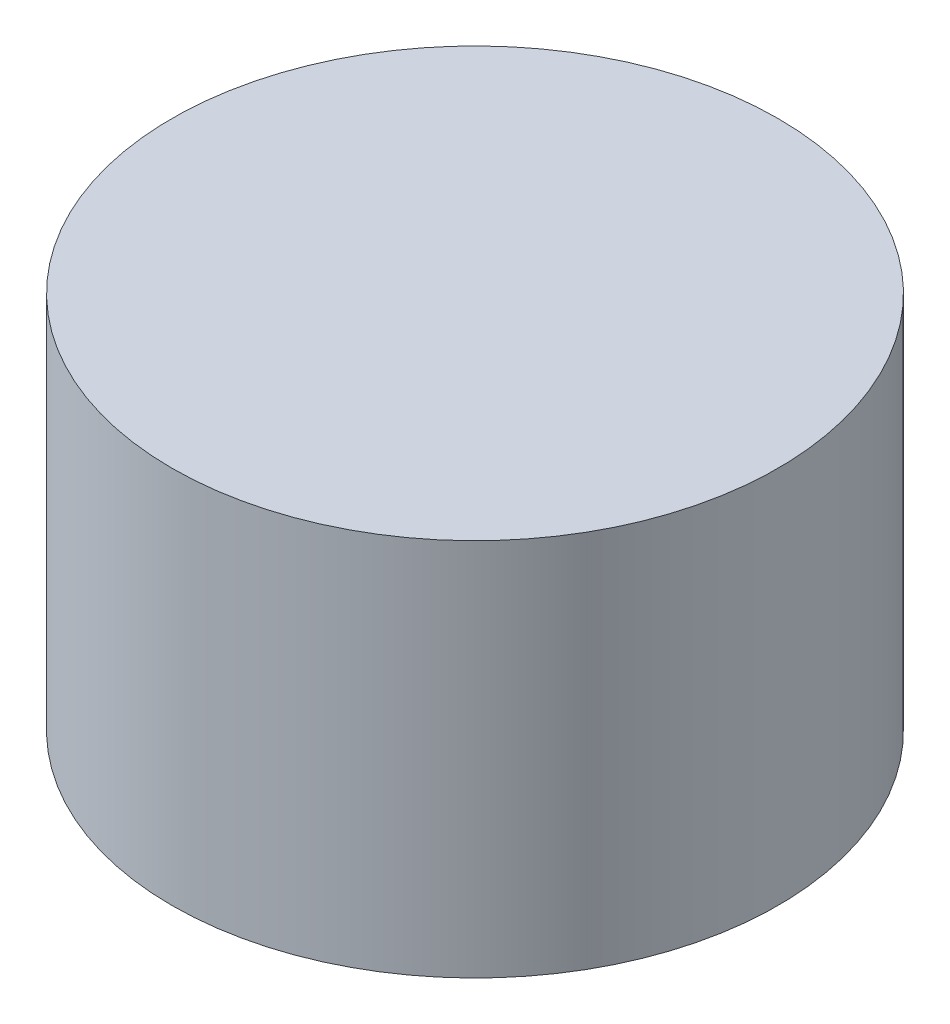
ISO-10303-21;
HEADER;
FILE_DESCRIPTION(('STEP AP214'),'2;1');
FILE_NAME('part.step','',(''),(''),'','','');
FILE_SCHEMA(('AUTOMOTIVE_DESIGN { 1 0 10303 214 1 1 1 1 }'));
ENDSEC;
DATA;
#1=APPLICATION_CONTEXT('core data for automotive mechanical design processes');
#2=APPLICATION_PROTOCOL_DEFINITION('international standard','automotive_design',2000,#1);
#3=PRODUCT_CONTEXT('',#1,'mechanical');
#4=PRODUCT('Part','Part','',(#3));
#5=PRODUCT_RELATED_PRODUCT_CATEGORY('part','',(#4));
#6=PRODUCT_DEFINITION_FORMATION('','',#4);
#7=PRODUCT_DEFINITION_CONTEXT('part definition',#1,'design');
#8=PRODUCT_DEFINITION('design','',#6,#7);
#9=PRODUCT_DEFINITION_SHAPE('','',#8);
#10=(LENGTH_UNIT() NAMED_UNIT(*) SI_UNIT(.MILLI.,.METRE.));
#11=(NAMED_UNIT(*) PLANE_ANGLE_UNIT() SI_UNIT($,.RADIAN.));
#12=(NAMED_UNIT(*) SI_UNIT($,.STERADIAN.) SOLID_ANGLE_UNIT());
#13=UNCERTAINTY_MEASURE_WITH_UNIT(LENGTH_MEASURE(1.E-05),#10,'distance_accuracy_value','');
#14=(GEOMETRIC_REPRESENTATION_CONTEXT(3) GLOBAL_UNCERTAINTY_ASSIGNED_CONTEXT((#13)) GLOBAL_UNIT_ASSIGNED_CONTEXT((#10,
#11,#12)) REPRESENTATION_CONTEXT('',''));
#15=CARTESIAN_POINT('',(0.,0.,0.));
#16=DIRECTION('',(0.,0.,1.));
#17=DIRECTION('',(1.,0.,0.));
#18=AXIS2_PLACEMENT_3D('',#15,#16,#17);
#19=CARTESIAN_POINT('',(0.,7.9375,0.));
#20=DIRECTION('',(0.,-1.,0.));
#21=DIRECTION('',(0.,0.,-1.));
#22=AXIS2_PLACEMENT_3D('',#19,#20,#21);
#23=CYLINDRICAL_SURFACE('',#22,6.35);
#24=CARTESIAN_POINT('',(0.,7.9375,0.));
#25=DIRECTION('',(0.,1.,0.));
#26=DIRECTION('',(0.,0.,1.));
#27=AXIS2_PLACEMENT_3D('',#24,#25,#26);
#28=CIRCLE('',#27,6.35);
#29=CARTESIAN_POINT('',(0.,7.9375,6.35));
#30=VERTEX_POINT('',#29);
#31=EDGE_CURVE('E10',#30,#30,#28,.T.);
#32=ORIENTED_EDGE('',*,*,#31,.F.);
#33=EDGE_LOOP('',(#32));
#34=FACE_BOUND('',#33,.T.);
#35=CARTESIAN_POINT('',(0.,0.,0.));
#36=DIRECTION('',(0.,1.,0.));
#37=DIRECTION('',(0.,0.,1.));
#38=AXIS2_PLACEMENT_3D('',#35,#36,#37);
#39=CIRCLE('',#38,6.35);
#40=CARTESIAN_POINT('',(0.,0.,6.35));
#41=VERTEX_POINT('',#40);
#42=EDGE_CURVE('E38',#41,#41,#39,.T.);
#43=ORIENTED_EDGE('',*,*,#42,.T.);
#44=EDGE_LOOP('',(#43));
#45=FACE_BOUND('',#44,.T.);
#46=ADVANCED_FACE('F35',(#34,#45),#23,.T.);
#47=CARTESIAN_POINT('',(0.,7.9375,0.));
#48=DIRECTION('',(0.,1.,0.));
#49=DIRECTION('',(0.,0.,1.));
#50=AXIS2_PLACEMENT_3D('',#47,#48,#49);
#51=PLANE('',#50);
#52=ORIENTED_EDGE('',*,*,#31,.T.);
#53=EDGE_LOOP('',(#52));
#54=FACE_BOUND('',#53,.T.);
#55=ADVANCED_FACE('F50',(#54),#51,.T.);
#56=CARTESIAN_POINT('',(0.,0.,0.));
#57=DIRECTION('',(0.,1.,0.));
#58=DIRECTION('',(0.,0.,1.));
#59=AXIS2_PLACEMENT_3D('',#56,#57,#58);
#60=PLANE('',#59);
#61=ORIENTED_EDGE('',*,*,#42,.F.);
#62=EDGE_LOOP('',(#61));
#63=FACE_BOUND('',#62,.T.);
#64=ADVANCED_FACE('F48',(#63),#60,.F.);
#65=CLOSED_SHELL('',(#46,#55,#64));
#66=MANIFOLD_SOLID_BREP('B2',#65);
#67=ADVANCED_BREP_SHAPE_REPRESENTATION('',(#18,#66),#14);
#68=SHAPE_DEFINITION_REPRESENTATION(#9,#67);
ENDSEC;
END-ISO-10303-21;
